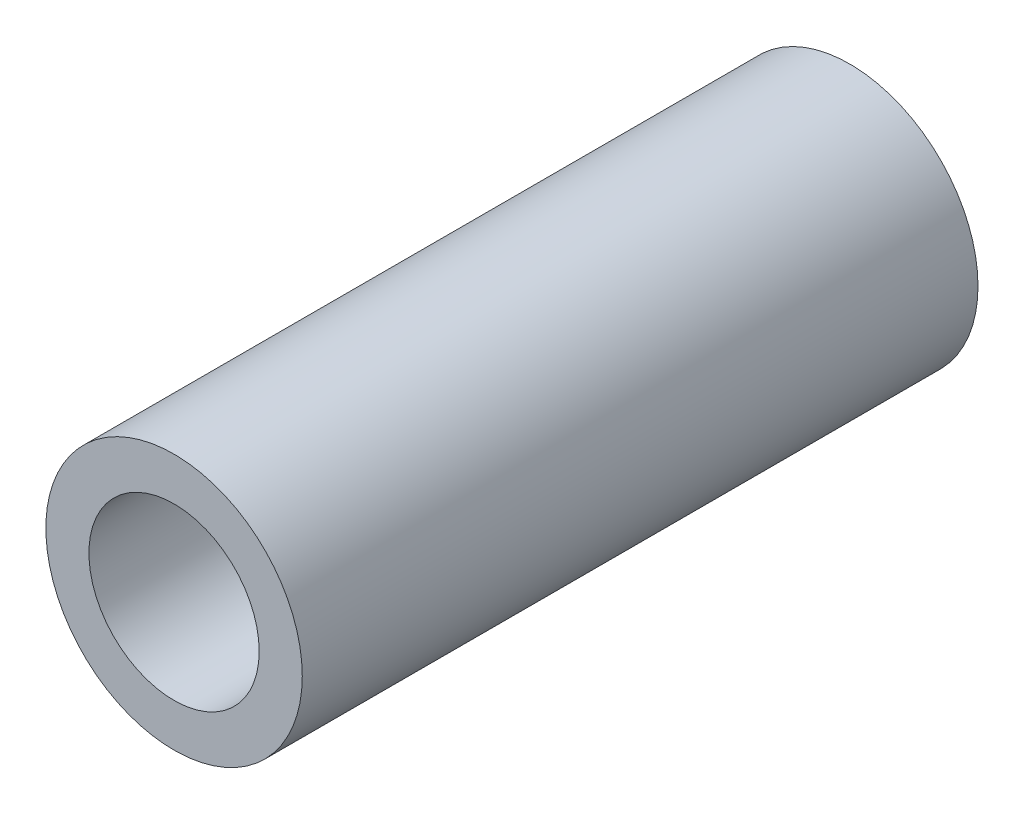
ISO-10303-21;
HEADER;
FILE_DESCRIPTION(('STEP AP214'),'2;1');
FILE_NAME('part.step','',(''),(''),'','','');
FILE_SCHEMA(('AUTOMOTIVE_DESIGN { 1 0 10303 214 1 1 1 1 }'));
ENDSEC;
DATA;
#1=APPLICATION_CONTEXT('core data for automotive mechanical design processes');
#2=APPLICATION_PROTOCOL_DEFINITION('international standard','automotive_design',2000,#1);
#3=PRODUCT_CONTEXT('',#1,'mechanical');
#4=PRODUCT('Part','Part','',(#3));
#5=PRODUCT_RELATED_PRODUCT_CATEGORY('part','',(#4));
#6=PRODUCT_DEFINITION_FORMATION('','',#4);
#7=PRODUCT_DEFINITION_CONTEXT('part definition',#1,'design');
#8=PRODUCT_DEFINITION('design','',#6,#7);
#9=PRODUCT_DEFINITION_SHAPE('','',#8);
#10=(LENGTH_UNIT() NAMED_UNIT(*) SI_UNIT(.MILLI.,.METRE.));
#11=(NAMED_UNIT(*) PLANE_ANGLE_UNIT() SI_UNIT($,.RADIAN.));
#12=(NAMED_UNIT(*) SI_UNIT($,.STERADIAN.) SOLID_ANGLE_UNIT());
#13=UNCERTAINTY_MEASURE_WITH_UNIT(LENGTH_MEASURE(1.E-05),#10,'distance_accuracy_value','');
#14=(GEOMETRIC_REPRESENTATION_CONTEXT(3) GLOBAL_UNCERTAINTY_ASSIGNED_CONTEXT((#13)) GLOBAL_UNIT_ASSIGNED_CONTEXT((#10,
#11,#12)) REPRESENTATION_CONTEXT('',''));
#15=CARTESIAN_POINT('',(0.,0.,0.));
#16=DIRECTION('',(0.,0.,1.));
#17=DIRECTION('',(1.,0.,0.));
#18=AXIS2_PLACEMENT_3D('',#15,#16,#17);
#19=CARTESIAN_POINT('',(0.,0.,12.55));
#20=DIRECTION('',(0.,0.,1.));
#21=DIRECTION('',(1.,0.,0.));
#22=AXIS2_PLACEMENT_3D('',#19,#20,#21);
#23=PLANE('',#22);
#24=CARTESIAN_POINT('',(0.,0.,12.55));
#25=DIRECTION('',(0.,0.,1.));
#26=DIRECTION('',(1.,0.,0.));
#27=AXIS2_PLACEMENT_3D('',#24,#25,#26);
#28=CIRCLE('',#27,2.38125);
#29=CARTESIAN_POINT('',(2.38125,0.,12.55));
#30=VERTEX_POINT('',#29);
#31=EDGE_CURVE('E10',#30,#30,#28,.T.);
#32=ORIENTED_EDGE('',*,*,#31,.T.);
#33=EDGE_LOOP('',(#32));
#34=FACE_BOUND('',#33,.T.);
#35=CARTESIAN_POINT('',(0.,0.,12.55));
#36=DIRECTION('',(0.,0.,1.));
#37=DIRECTION('',(1.,0.,0.));
#38=AXIS2_PLACEMENT_3D('',#35,#36,#37);
#39=CIRCLE('',#38,1.58125);
#40=CARTESIAN_POINT('',(1.58125,0.,12.55));
#41=VERTEX_POINT('',#40);
#42=EDGE_CURVE('E42',#41,#41,#39,.T.);
#43=ORIENTED_EDGE('',*,*,#42,.F.);
#44=EDGE_LOOP('',(#43));
#45=FACE_BOUND('',#44,.T.);
#46=ADVANCED_FACE('F31',(#34,#45),#23,.T.);
#47=CARTESIAN_POINT('',(0.,0.,0.));
#48=DIRECTION('',(0.,0.,1.));
#49=DIRECTION('',(1.,0.,0.));
#50=AXIS2_PLACEMENT_3D('',#47,#48,#49);
#51=PLANE('',#50);
#52=CARTESIAN_POINT('',(0.,0.,0.));
#53=DIRECTION('',(0.,0.,1.));
#54=DIRECTION('',(1.,0.,0.));
#55=AXIS2_PLACEMENT_3D('',#52,#53,#54);
#56=CIRCLE('',#55,2.38125);
#57=CARTESIAN_POINT('',(2.38125,0.,0.));
#58=VERTEX_POINT('',#57);
#59=EDGE_CURVE('E35',#58,#58,#56,.T.);
#60=ORIENTED_EDGE('',*,*,#59,.F.);
#61=EDGE_LOOP('',(#60));
#62=FACE_BOUND('',#61,.T.);
#63=CARTESIAN_POINT('',(0.,0.,0.));
#64=DIRECTION('',(0.,0.,1.));
#65=DIRECTION('',(1.,0.,0.));
#66=AXIS2_PLACEMENT_3D('',#63,#64,#65);
#67=CIRCLE('',#66,1.58125);
#68=CARTESIAN_POINT('',(1.58125,0.,0.));
#69=VERTEX_POINT('',#68);
#70=EDGE_CURVE('E44',#69,#69,#67,.T.);
#71=ORIENTED_EDGE('',*,*,#70,.T.);
#72=EDGE_LOOP('',(#71));
#73=FACE_BOUND('',#72,.T.);
#74=ADVANCED_FACE('F54',(#62,#73),#51,.F.);
#75=CARTESIAN_POINT('',(0.,0.,12.55));
#76=DIRECTION('',(0.,0.,-1.));
#77=DIRECTION('',(-1.,0.,0.));
#78=AXIS2_PLACEMENT_3D('',#75,#76,#77);
#79=CYLINDRICAL_SURFACE('',#78,2.38125);
#80=ORIENTED_EDGE('',*,*,#31,.F.);
#81=EDGE_LOOP('',(#80));
#82=FACE_BOUND('',#81,.T.);
#83=ORIENTED_EDGE('',*,*,#59,.T.);
#84=EDGE_LOOP('',(#83));
#85=FACE_BOUND('',#84,.T.);
#86=ADVANCED_FACE('F33',(#82,#85),#79,.T.);
#87=CARTESIAN_POINT('',(0.,0.,12.55));
#88=DIRECTION('',(0.,0.,-1.));
#89=DIRECTION('',(-1.,0.,0.));
#90=AXIS2_PLACEMENT_3D('',#87,#88,#89);
#91=CYLINDRICAL_SURFACE('',#90,1.58125);
#92=ORIENTED_EDGE('',*,*,#42,.T.);
#93=EDGE_LOOP('',(#92));
#94=FACE_BOUND('',#93,.T.);
#95=ORIENTED_EDGE('',*,*,#70,.F.);
#96=EDGE_LOOP('',(#95));
#97=FACE_BOUND('',#96,.T.);
#98=ADVANCED_FACE('F50',(#94,#97),#91,.F.);
#99=CLOSED_SHELL('',(#46,#74,#86,#98));
#100=MANIFOLD_SOLID_BREP('B2',#99);
#101=ADVANCED_BREP_SHAPE_REPRESENTATION('',(#18,#100),#14);
#102=SHAPE_DEFINITION_REPRESENTATION(#9,#101);
ENDSEC;
END-ISO-10303-21;
